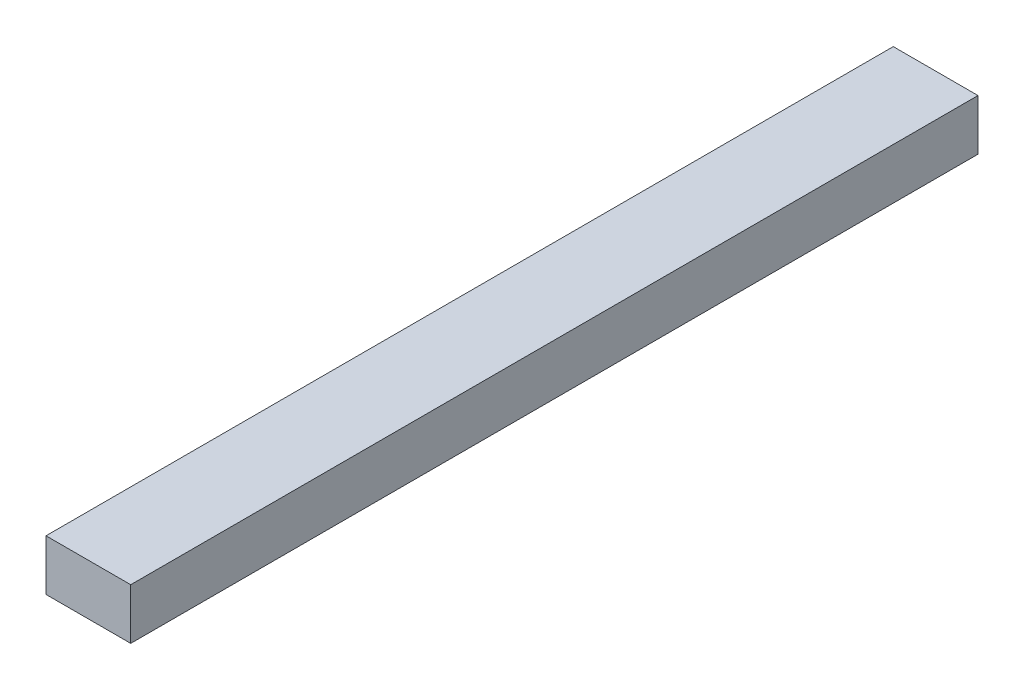
ISO-10303-21;
HEADER;
FILE_DESCRIPTION(('STEP AP214'),'2;1');
FILE_NAME('part.step','',(''),(''),'','','');
FILE_SCHEMA(('AUTOMOTIVE_DESIGN { 1 0 10303 214 1 1 1 1 }'));
ENDSEC;
DATA;
#1=APPLICATION_CONTEXT('core data for automotive mechanical design processes');
#2=APPLICATION_PROTOCOL_DEFINITION('international standard','automotive_design',2000,#1);
#3=PRODUCT_CONTEXT('',#1,'mechanical');
#4=PRODUCT('Part','Part','',(#3));
#5=PRODUCT_RELATED_PRODUCT_CATEGORY('part','',(#4));
#6=PRODUCT_DEFINITION_FORMATION('','',#4);
#7=PRODUCT_DEFINITION_CONTEXT('part definition',#1,'design');
#8=PRODUCT_DEFINITION('design','',#6,#7);
#9=PRODUCT_DEFINITION_SHAPE('','',#8);
#10=(LENGTH_UNIT() NAMED_UNIT(*) SI_UNIT(.MILLI.,.METRE.));
#11=(NAMED_UNIT(*) PLANE_ANGLE_UNIT() SI_UNIT($,.RADIAN.));
#12=(NAMED_UNIT(*) SI_UNIT($,.STERADIAN.) SOLID_ANGLE_UNIT());
#13=UNCERTAINTY_MEASURE_WITH_UNIT(LENGTH_MEASURE(1.E-05),#10,'distance_accuracy_value','');
#14=(GEOMETRIC_REPRESENTATION_CONTEXT(3) GLOBAL_UNCERTAINTY_ASSIGNED_CONTEXT((#13)) GLOBAL_UNIT_ASSIGNED_CONTEXT((#10,
#11,#12)) REPRESENTATION_CONTEXT('',''));
#15=CARTESIAN_POINT('',(0.,0.,0.));
#16=DIRECTION('',(0.,0.,1.));
#17=DIRECTION('',(1.,0.,0.));
#18=AXIS2_PLACEMENT_3D('',#15,#16,#17);
#19=CARTESIAN_POINT('',(2.5,3.,-25.));
#20=DIRECTION('',(-1.,0.,0.));
#21=DIRECTION('',(0.,0.,1.));
#22=AXIS2_PLACEMENT_3D('',#19,#20,#21);
#23=PLANE('',#22);
#24=DIRECTION('',(0.,0.,-1.));
#25=VECTOR('',#24,1.);
#26=CARTESIAN_POINT('',(2.5,0.,-25.));
#27=LINE('',#26,#25);
#28=CARTESIAN_POINT('',(2.5,0.,25.));
#29=VERTEX_POINT('',#28);
#30=CARTESIAN_POINT('',(2.5,0.,-25.));
#31=VERTEX_POINT('',#30);
#32=EDGE_CURVE('E98',#29,#31,#27,.T.);
#33=ORIENTED_EDGE('',*,*,#32,.T.);
#34=DIRECTION('',(0.,-1.,0.));
#35=VECTOR('',#34,1.);
#36=CARTESIAN_POINT('',(2.5,3.,-25.));
#37=LINE('',#36,#35);
#38=CARTESIAN_POINT('',(2.5,3.,-25.));
#39=VERTEX_POINT('',#38);
#40=EDGE_CURVE('E11',#39,#31,#37,.T.);
#41=ORIENTED_EDGE('',*,*,#40,.F.);
#42=DIRECTION('',(0.,0.,-1.));
#43=VECTOR('',#42,1.);
#44=CARTESIAN_POINT('',(2.5,3.,-25.));
#45=LINE('',#44,#43);
#46=CARTESIAN_POINT('',(2.5,3.,25.));
#47=VERTEX_POINT('',#46);
#48=EDGE_CURVE('E86',#47,#39,#45,.T.);
#49=ORIENTED_EDGE('',*,*,#48,.F.);
#50=DIRECTION('',(0.,-1.,0.));
#51=VECTOR('',#50,1.);
#52=CARTESIAN_POINT('',(2.5,3.,25.));
#53=LINE('',#52,#51);
#54=EDGE_CURVE('E94',#47,#29,#53,.T.);
#55=ORIENTED_EDGE('',*,*,#54,.T.);
#56=EDGE_LOOP('',(#33,#41,#49,#55));
#57=FACE_BOUND('',#56,.T.);
#58=ADVANCED_FACE('F35',(#57),#23,.F.);
#59=CARTESIAN_POINT('',(-2.5,3.,-25.));
#60=DIRECTION('',(0.,0.,1.));
#61=DIRECTION('',(1.,0.,0.));
#62=AXIS2_PLACEMENT_3D('',#59,#60,#61);
#63=PLANE('',#62);
#64=DIRECTION('',(-1.,0.,0.));
#65=VECTOR('',#64,1.);
#66=CARTESIAN_POINT('',(-2.5,0.,-25.));
#67=LINE('',#66,#65);
#68=CARTESIAN_POINT('',(-2.5,0.,-25.));
#69=VERTEX_POINT('',#68);
#70=EDGE_CURVE('E90',#31,#69,#67,.T.);
#71=ORIENTED_EDGE('',*,*,#70,.T.);
#72=DIRECTION('',(0.,-1.,0.));
#73=VECTOR('',#72,1.);
#74=CARTESIAN_POINT('',(-2.5,3.,-25.));
#75=LINE('',#74,#73);
#76=CARTESIAN_POINT('',(-2.5,3.,-25.));
#77=VERTEX_POINT('',#76);
#78=EDGE_CURVE('E43',#77,#69,#75,.T.);
#79=ORIENTED_EDGE('',*,*,#78,.F.);
#80=DIRECTION('',(-1.,0.,0.));
#81=VECTOR('',#80,1.);
#82=CARTESIAN_POINT('',(-2.5,3.,-25.));
#83=LINE('',#82,#81);
#84=EDGE_CURVE('E81',#39,#77,#83,.T.);
#85=ORIENTED_EDGE('',*,*,#84,.F.);
#86=ORIENTED_EDGE('',*,*,#40,.T.);
#87=EDGE_LOOP('',(#71,#79,#85,#86));
#88=FACE_BOUND('',#87,.T.);
#89=ADVANCED_FACE('F89',(#88),#63,.F.);
#90=CARTESIAN_POINT('',(-2.5,3.,-25.));
#91=DIRECTION('',(1.,0.,0.));
#92=DIRECTION('',(0.,0.,-1.));
#93=AXIS2_PLACEMENT_3D('',#90,#91,#92);
#94=PLANE('',#93);
#95=DIRECTION('',(0.,0.,1.));
#96=VECTOR('',#95,1.);
#97=CARTESIAN_POINT('',(-2.5,0.,-25.));
#98=LINE('',#97,#96);
#99=CARTESIAN_POINT('',(-2.5,0.,25.));
#100=VERTEX_POINT('',#99);
#101=EDGE_CURVE('E68',#69,#100,#98,.T.);
#102=ORIENTED_EDGE('',*,*,#101,.T.);
#103=DIRECTION('',(0.,-1.,0.));
#104=VECTOR('',#103,1.);
#105=CARTESIAN_POINT('',(-2.5,3.,25.));
#106=LINE('',#105,#104);
#107=CARTESIAN_POINT('',(-2.5,3.,25.));
#108=VERTEX_POINT('',#107);
#109=EDGE_CURVE('E91',#108,#100,#106,.T.);
#110=ORIENTED_EDGE('',*,*,#109,.F.);
#111=DIRECTION('',(0.,0.,1.));
#112=VECTOR('',#111,1.);
#113=CARTESIAN_POINT('',(-2.5,3.,-25.));
#114=LINE('',#113,#112);
#115=EDGE_CURVE('E84',#77,#108,#114,.T.);
#116=ORIENTED_EDGE('',*,*,#115,.F.);
#117=ORIENTED_EDGE('',*,*,#78,.T.);
#118=EDGE_LOOP('',(#102,#110,#116,#117));
#119=FACE_BOUND('',#118,.T.);
#120=ADVANCED_FACE('F92',(#119),#94,.F.);
#121=CARTESIAN_POINT('',(-2.5,3.,25.));
#122=DIRECTION('',(0.,0.,-1.));
#123=DIRECTION('',(-1.,0.,0.));
#124=AXIS2_PLACEMENT_3D('',#121,#122,#123);
#125=PLANE('',#124);
#126=DIRECTION('',(1.,0.,0.));
#127=VECTOR('',#126,1.);
#128=CARTESIAN_POINT('',(-2.5,0.,25.));
#129=LINE('',#128,#127);
#130=EDGE_CURVE('E74',#100,#29,#129,.T.);
#131=ORIENTED_EDGE('',*,*,#130,.T.);
#132=ORIENTED_EDGE('',*,*,#54,.F.);
#133=DIRECTION('',(1.,0.,0.));
#134=VECTOR('',#133,1.);
#135=CARTESIAN_POINT('',(-2.5,3.,25.));
#136=LINE('',#135,#134);
#137=EDGE_CURVE('E51',#108,#47,#136,.T.);
#138=ORIENTED_EDGE('',*,*,#137,.F.);
#139=ORIENTED_EDGE('',*,*,#109,.T.);
#140=EDGE_LOOP('',(#131,#132,#138,#139));
#141=FACE_BOUND('',#140,.T.);
#142=ADVANCED_FACE('F105',(#141),#125,.F.);
#143=CARTESIAN_POINT('',(0.,3.,0.));
#144=DIRECTION('',(0.,1.,0.));
#145=DIRECTION('',(0.,0.,1.));
#146=AXIS2_PLACEMENT_3D('',#143,#144,#145);
#147=PLANE('',#146);
#148=ORIENTED_EDGE('',*,*,#48,.T.);
#149=ORIENTED_EDGE('',*,*,#84,.T.);
#150=ORIENTED_EDGE('',*,*,#115,.T.);
#151=ORIENTED_EDGE('',*,*,#137,.T.);
#152=EDGE_LOOP('',(#148,#149,#150,#151));
#153=FACE_BOUND('',#152,.T.);
#154=ADVANCED_FACE('F82',(#153),#147,.T.);
#155=CARTESIAN_POINT('',(0.,0.,0.));
#156=DIRECTION('',(0.,1.,0.));
#157=DIRECTION('',(0.,0.,1.));
#158=AXIS2_PLACEMENT_3D('',#155,#156,#157);
#159=PLANE('',#158);
#160=ORIENTED_EDGE('',*,*,#32,.F.);
#161=ORIENTED_EDGE('',*,*,#130,.F.);
#162=ORIENTED_EDGE('',*,*,#101,.F.);
#163=ORIENTED_EDGE('',*,*,#70,.F.);
#164=EDGE_LOOP('',(#160,#161,#162,#163));
#165=FACE_BOUND('',#164,.T.);
#166=ADVANCED_FACE('F108',(#165),#159,.F.);
#167=CLOSED_SHELL('',(#58,#89,#120,#142,#154,#166));
#168=MANIFOLD_SOLID_BREP('B2',#167);
#169=ADVANCED_BREP_SHAPE_REPRESENTATION('',(#18,#168),#14);
#170=SHAPE_DEFINITION_REPRESENTATION(#9,#169);
ENDSEC;
END-ISO-10303-21;
